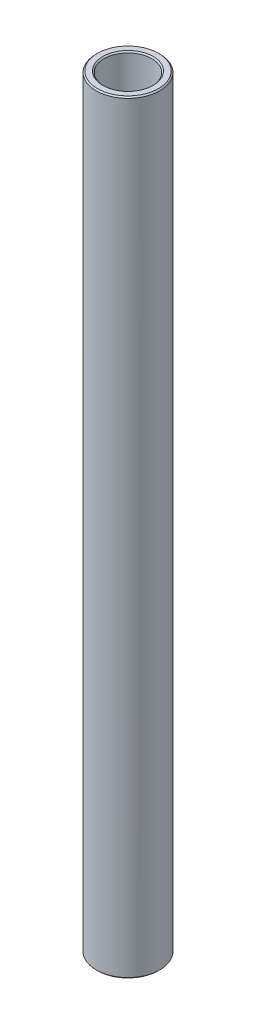
ISO-10303-21;
HEADER;
FILE_DESCRIPTION(('STEP AP214'),'2;1');
FILE_NAME('part.step','',(''),(''),'','','');
FILE_SCHEMA(('AUTOMOTIVE_DESIGN { 1 0 10303 214 1 1 1 1 }'));
ENDSEC;
DATA;
#1=APPLICATION_CONTEXT('core data for automotive mechanical design processes');
#2=APPLICATION_PROTOCOL_DEFINITION('international standard','automotive_design',2000,#1);
#3=PRODUCT_CONTEXT('',#1,'mechanical');
#4=PRODUCT('Part','Part','',(#3));
#5=PRODUCT_RELATED_PRODUCT_CATEGORY('part','',(#4));
#6=PRODUCT_DEFINITION_FORMATION('','',#4);
#7=PRODUCT_DEFINITION_CONTEXT('part definition',#1,'design');
#8=PRODUCT_DEFINITION('design','',#6,#7);
#9=PRODUCT_DEFINITION_SHAPE('','',#8);
#10=(LENGTH_UNIT() NAMED_UNIT(*) SI_UNIT(.MILLI.,.METRE.));
#11=(NAMED_UNIT(*) PLANE_ANGLE_UNIT() SI_UNIT($,.RADIAN.));
#12=(NAMED_UNIT(*) SI_UNIT($,.STERADIAN.) SOLID_ANGLE_UNIT());
#13=UNCERTAINTY_MEASURE_WITH_UNIT(LENGTH_MEASURE(1.E-05),#10,'distance_accuracy_value','');
#14=(GEOMETRIC_REPRESENTATION_CONTEXT(3) GLOBAL_UNCERTAINTY_ASSIGNED_CONTEXT((#13)) GLOBAL_UNIT_ASSIGNED_CONTEXT((#10,
#11,#12)) REPRESENTATION_CONTEXT('',''));
#15=CARTESIAN_POINT('',(0.,0.,0.));
#16=DIRECTION('',(0.,0.,1.));
#17=DIRECTION('',(1.,0.,0.));
#18=AXIS2_PLACEMENT_3D('',#15,#16,#17);
#19=CARTESIAN_POINT('',(0.,11.60859375,0.));
#20=DIRECTION('',(0.,1.,0.));
#21=DIRECTION('',(-1.,0.,0.));
#22=AXIS2_PLACEMENT_3D('',#19,#20,#21);
#23=CYLINDRICAL_SURFACE('',#22,4.7625);
#24=CARTESIAN_POINT('',(0.,-75.946,0.));
#25=DIRECTION('',(0.,1.,0.));
#26=DIRECTION('',(-1.,0.,0.));
#27=AXIS2_PLACEMENT_3D('',#24,#25,#26);
#28=CIRCLE('',#27,4.7625);
#29=CARTESIAN_POINT('',(-4.76250000000001,-75.946,0.));
#30=VERTEX_POINT('',#29);
#31=EDGE_CURVE('E54',#30,#30,#28,.F.);
#32=ORIENTED_EDGE('',*,*,#31,.T.);
#33=EDGE_LOOP('',(#32));
#34=FACE_BOUND('',#33,.T.);
#35=CARTESIAN_POINT('',(0.,75.9460000000001,0.));
#36=DIRECTION('',(0.,-1.,0.));
#37=DIRECTION('',(1.,0.,0.));
#38=AXIS2_PLACEMENT_3D('',#35,#36,#37);
#39=CIRCLE('',#38,4.7625);
#40=CARTESIAN_POINT('',(4.76250000000001,75.9460000000001,0.));
#41=VERTEX_POINT('',#40);
#42=EDGE_CURVE('E57',#41,#41,#39,.F.);
#43=ORIENTED_EDGE('',*,*,#42,.T.);
#44=EDGE_LOOP('',(#43));
#45=FACE_BOUND('',#44,.T.);
#46=ADVANCED_FACE('F34',(#34,#45),#23,.F.);
#47=CARTESIAN_POINT('',(4.76249999999999,76.2,0.));
#48=DIRECTION('',(0.,-1.,0.));
#49=DIRECTION('',(1.,0.,0.));
#50=AXIS2_PLACEMENT_3D('',#47,#48,#49);
#51=PLANE('',#50);
#52=CARTESIAN_POINT('',(0.,76.2,0.));
#53=DIRECTION('',(0.,-1.,0.));
#54=DIRECTION('',(1.,0.,0.));
#55=AXIS2_PLACEMENT_3D('',#52,#53,#54);
#56=CIRCLE('',#55,6.09599999999997);
#57=CARTESIAN_POINT('',(6.09599999999999,76.2,0.));
#58=VERTEX_POINT('',#57);
#59=EDGE_CURVE('E10',#58,#58,#56,.F.);
#60=ORIENTED_EDGE('',*,*,#59,.T.);
#61=EDGE_LOOP('',(#60));
#62=FACE_BOUND('',#61,.T.);
#63=CARTESIAN_POINT('',(0.,76.2,0.));
#64=DIRECTION('',(0.,-1.,0.));
#65=DIRECTION('',(1.,0.,0.));
#66=AXIS2_PLACEMENT_3D('',#63,#64,#65);
#67=CIRCLE('',#66,5.01649999999997);
#68=CARTESIAN_POINT('',(5.01649999999998,76.2,0.));
#69=VERTEX_POINT('',#68);
#70=EDGE_CURVE('E41',#69,#69,#67,.T.);
#71=ORIENTED_EDGE('',*,*,#70,.T.);
#72=EDGE_LOOP('',(#71));
#73=FACE_BOUND('',#72,.T.);
#74=ADVANCED_FACE('F80',(#62,#73),#51,.F.);
#75=CARTESIAN_POINT('',(0.,11.60859375,0.));
#76=DIRECTION('',(0.,1.,0.));
#77=DIRECTION('',(-1.,0.,0.));
#78=AXIS2_PLACEMENT_3D('',#75,#76,#77);
#79=CYLINDRICAL_SURFACE('',#78,6.35);
#80=CARTESIAN_POINT('',(0.,-75.9459999999999,0.));
#81=DIRECTION('',(0.,1.,0.));
#82=DIRECTION('',(-1.,0.,0.));
#83=AXIS2_PLACEMENT_3D('',#80,#81,#82);
#84=CIRCLE('',#83,6.35);
#85=CARTESIAN_POINT('',(-6.35000000000001,-75.9459999999999,0.));
#86=VERTEX_POINT('',#85);
#87=EDGE_CURVE('E45',#86,#86,#84,.T.);
#88=ORIENTED_EDGE('',*,*,#87,.T.);
#89=EDGE_LOOP('',(#88));
#90=FACE_BOUND('',#89,.T.);
#91=CARTESIAN_POINT('',(0.,75.946,0.));
#92=DIRECTION('',(0.,-1.,0.));
#93=DIRECTION('',(1.,0.,0.));
#94=AXIS2_PLACEMENT_3D('',#91,#92,#93);
#95=CIRCLE('',#94,6.35);
#96=CARTESIAN_POINT('',(6.35000000000001,75.946,0.));
#97=VERTEX_POINT('',#96);
#98=EDGE_CURVE('E49',#97,#97,#95,.T.);
#99=ORIENTED_EDGE('',*,*,#98,.T.);
#100=EDGE_LOOP('',(#99));
#101=FACE_BOUND('',#100,.T.);
#102=ADVANCED_FACE('F77',(#90,#101),#79,.T.);
#103=CARTESIAN_POINT('',(6.35000000000001,-76.2,0.));
#104=DIRECTION('',(0.,1.,0.));
#105=DIRECTION('',(-1.,0.,0.));
#106=AXIS2_PLACEMENT_3D('',#103,#104,#105);
#107=PLANE('',#106);
#108=CARTESIAN_POINT('',(0.,-76.2,0.));
#109=DIRECTION('',(0.,1.,0.));
#110=DIRECTION('',(-1.,0.,0.));
#111=AXIS2_PLACEMENT_3D('',#108,#109,#110);
#112=CIRCLE('',#111,5.01650000000002);
#113=CARTESIAN_POINT('',(-5.01650000000003,-76.2,0.));
#114=VERTEX_POINT('',#113);
#115=EDGE_CURVE('E60',#114,#114,#112,.T.);
#116=ORIENTED_EDGE('',*,*,#115,.T.);
#117=EDGE_LOOP('',(#116));
#118=FACE_BOUND('',#117,.T.);
#119=CARTESIAN_POINT('',(0.,-76.2,0.));
#120=DIRECTION('',(0.,1.,0.));
#121=DIRECTION('',(-1.,0.,0.));
#122=AXIS2_PLACEMENT_3D('',#119,#120,#121);
#123=CIRCLE('',#122,6.09599999999993);
#124=CARTESIAN_POINT('',(-6.09599999999994,-76.2,0.));
#125=VERTEX_POINT('',#124);
#126=EDGE_CURVE('E63',#125,#125,#123,.F.);
#127=ORIENTED_EDGE('',*,*,#126,.T.);
#128=EDGE_LOOP('',(#127));
#129=FACE_BOUND('',#128,.T.);
#130=ADVANCED_FACE('F67',(#118,#129),#107,.F.);
#131=CARTESIAN_POINT('',(0.,-76.2,0.));
#132=DIRECTION('',(0.,-1.,0.));
#133=DIRECTION('',(1.,0.,0.));
#134=AXIS2_PLACEMENT_3D('',#131,#132,#133);
#135=CONICAL_SURFACE('',#134,5.01650000000002,0.78539816339745);
#136=ORIENTED_EDGE('',*,*,#31,.F.);
#137=EDGE_LOOP('',(#136));
#138=FACE_BOUND('',#137,.T.);
#139=ORIENTED_EDGE('',*,*,#115,.F.);
#140=EDGE_LOOP('',(#139));
#141=FACE_BOUND('',#140,.T.);
#142=ADVANCED_FACE('F73',(#138,#141),#135,.F.);
#143=CARTESIAN_POINT('',(0.,-75.9459999999999,0.));
#144=DIRECTION('',(0.,1.,0.));
#145=DIRECTION('',(-1.,0.,0.));
#146=AXIS2_PLACEMENT_3D('',#143,#144,#145);
#147=CONICAL_SURFACE('',#146,6.35,0.785398163397431);
#148=ORIENTED_EDGE('',*,*,#126,.F.);
#149=EDGE_LOOP('',(#148));
#150=FACE_BOUND('',#149,.T.);
#151=ORIENTED_EDGE('',*,*,#87,.F.);
#152=EDGE_LOOP('',(#151));
#153=FACE_BOUND('',#152,.T.);
#154=ADVANCED_FACE('F69',(#150,#153),#147,.T.);
#155=CARTESIAN_POINT('',(0.,76.2,0.));
#156=DIRECTION('',(0.,-1.,0.));
#157=DIRECTION('',(1.,0.,0.));
#158=AXIS2_PLACEMENT_3D('',#155,#156,#157);
#159=CONICAL_SURFACE('',#158,6.09599999999998,0.785398163397458);
#160=ORIENTED_EDGE('',*,*,#98,.F.);
#161=EDGE_LOOP('',(#160));
#162=FACE_BOUND('',#161,.T.);
#163=ORIENTED_EDGE('',*,*,#59,.F.);
#164=EDGE_LOOP('',(#163));
#165=FACE_BOUND('',#164,.T.);
#166=ADVANCED_FACE('F72',(#162,#165),#159,.T.);
#167=CARTESIAN_POINT('',(0.,75.9460000000001,0.));
#168=DIRECTION('',(0.,1.,0.));
#169=DIRECTION('',(-1.,0.,0.));
#170=AXIS2_PLACEMENT_3D('',#167,#168,#169);
#171=CONICAL_SURFACE('',#170,4.7625,0.78539816339745);
#172=ORIENTED_EDGE('',*,*,#70,.F.);
#173=EDGE_LOOP('',(#172));
#174=FACE_BOUND('',#173,.T.);
#175=ORIENTED_EDGE('',*,*,#42,.F.);
#176=EDGE_LOOP('',(#175));
#177=FACE_BOUND('',#176,.T.);
#178=ADVANCED_FACE('F36',(#174,#177),#171,.F.);
#179=CLOSED_SHELL('',(#46,#74,#102,#130,#142,#154,#166,#178));
#180=MANIFOLD_SOLID_BREP('B2',#179);
#181=ADVANCED_BREP_SHAPE_REPRESENTATION('',(#18,#180),#14);
#182=SHAPE_DEFINITION_REPRESENTATION(#9,#181);
ENDSEC;
END-ISO-10303-21;
